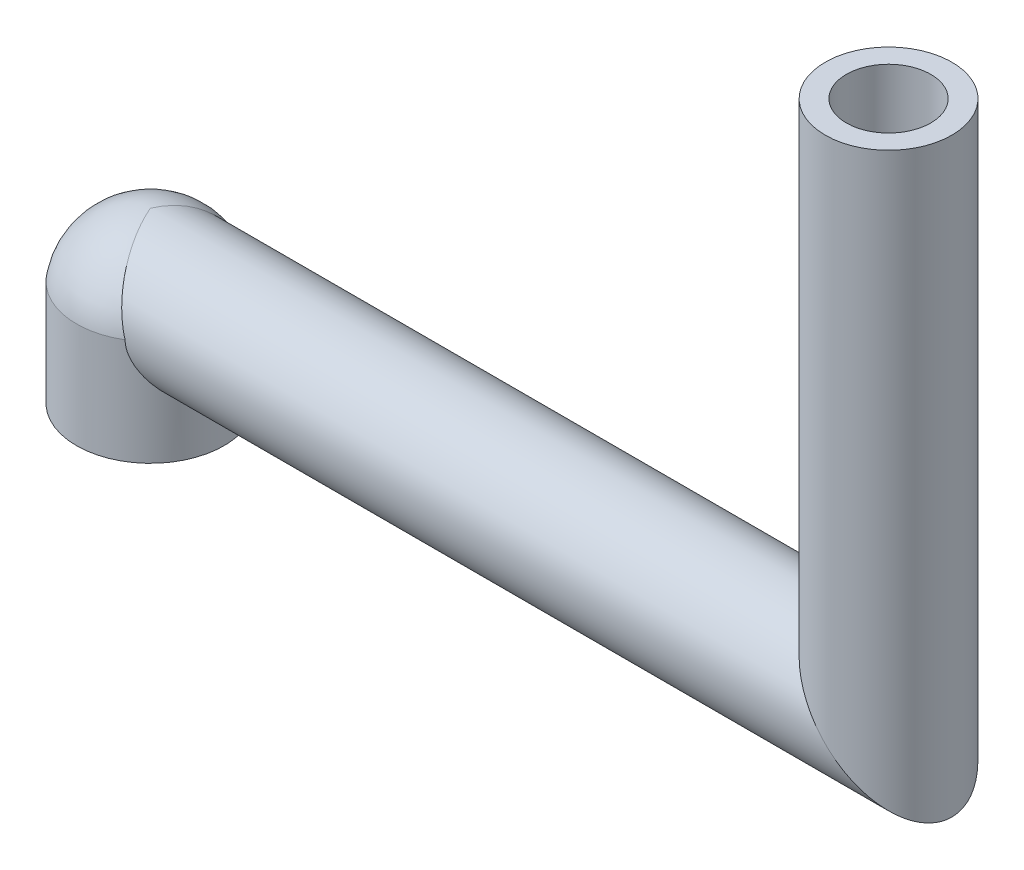
ISO-10303-21;
HEADER;
FILE_DESCRIPTION(('STEP AP214'),'2;1');
FILE_NAME('part.step','',(''),(''),'','','');
FILE_SCHEMA(('AUTOMOTIVE_DESIGN { 1 0 10303 214 1 1 1 1 }'));
ENDSEC;
DATA;
#1=APPLICATION_CONTEXT('core data for automotive mechanical design processes');
#2=APPLICATION_PROTOCOL_DEFINITION('international standard','automotive_design',2000,#1);
#3=PRODUCT_CONTEXT('',#1,'mechanical');
#4=PRODUCT('Part','Part','',(#3));
#5=PRODUCT_RELATED_PRODUCT_CATEGORY('part','',(#4));
#6=PRODUCT_DEFINITION_FORMATION('','',#4);
#7=PRODUCT_DEFINITION_CONTEXT('part definition',#1,'design');
#8=PRODUCT_DEFINITION('design','',#6,#7);
#9=PRODUCT_DEFINITION_SHAPE('','',#8);
#10=(LENGTH_UNIT() NAMED_UNIT(*) SI_UNIT(.MILLI.,.METRE.));
#11=(NAMED_UNIT(*) PLANE_ANGLE_UNIT() SI_UNIT($,.RADIAN.));
#12=(NAMED_UNIT(*) SI_UNIT($,.STERADIAN.) SOLID_ANGLE_UNIT());
#13=UNCERTAINTY_MEASURE_WITH_UNIT(LENGTH_MEASURE(1.E-05),#10,'distance_accuracy_value','');
#14=(GEOMETRIC_REPRESENTATION_CONTEXT(3) GLOBAL_UNCERTAINTY_ASSIGNED_CONTEXT((#13)) GLOBAL_UNIT_ASSIGNED_CONTEXT((#10,
#11,#12)) REPRESENTATION_CONTEXT('',''));
#15=CARTESIAN_POINT('',(0.,0.,0.));
#16=DIRECTION('',(0.,0.,1.));
#17=DIRECTION('',(1.,0.,0.));
#18=AXIS2_PLACEMENT_3D('',#15,#16,#17);
#19=CARTESIAN_POINT('',(0.,10.,0.));
#20=DIRECTION('',(0.,-1.,0.));
#21=DIRECTION('',(0.,0.,-1.));
#22=AXIS2_PLACEMENT_3D('',#19,#20,#21);
#23=CYLINDRICAL_SURFACE('',#22,7.);
#24=CARTESIAN_POINT('',(0.,0.,0.));
#25=DIRECTION('',(0.,1.,0.));
#26=DIRECTION('',(0.,0.,1.));
#27=AXIS2_PLACEMENT_3D('',#24,#25,#26);
#28=CIRCLE('',#27,7.);
#29=CARTESIAN_POINT('',(0.,0.,7.));
#30=VERTEX_POINT('',#29);
#31=EDGE_CURVE('E164',#30,#30,#28,.T.);
#32=ORIENTED_EDGE('',*,*,#31,.T.);
#33=EDGE_LOOP('',(#32));
#34=FACE_BOUND('',#33,.T.);
#35=CARTESIAN_POINT('',(3.60555127546396,10.,6.00000000000002));
#36=CARTESIAN_POINT('',(3.60547036212416,9.89804370812356,6.0000246722717));
#37=CARTESIAN_POINT('',(3.60987391766916,9.79613963751222,5.99740240844066));
#38=CARTESIAN_POINT('',(3.62701295704671,9.59350608039221,5.987065374599));
#39=CARTESIAN_POINT('',(3.63973063231986,9.4927745506641,5.979361488932));
#40=CARTESIAN_POINT('',(3.67260481569028,9.29468660937846,5.95922097253559));
#41=CARTESIAN_POINT('',(3.69264095359341,9.19730202604284,5.94686082773026));
#42=CARTESIAN_POINT('',(3.73922423302548,9.00474910130982,5.91768214083916));
#43=CARTESIAN_POINT('',(3.7657753228357,8.90958214230653,5.90086089467351));
#44=CARTESIAN_POINT('',(3.83691456380175,8.68160904095072,5.85495992001992));
#45=CARTESIAN_POINT('',(3.88435847056552,8.55012986512836,5.82371511395505));
#46=CARTESIAN_POINT('',(3.98761571608594,8.29265972277671,5.75350486483388));
#47=CARTESIAN_POINT('',(4.04343277746516,8.16667122966633,5.71453598524148));
#48=CARTESIAN_POINT('',(4.16156235964495,7.91900302304048,5.62909902100389));
#49=CARTESIAN_POINT('',(4.22392610410763,7.79736908921336,5.58256995309911));
#50=CARTESIAN_POINT('',(4.3528500422748,7.55923893407384,5.48264179156024));
#51=CARTESIAN_POINT('',(4.41941166274536,7.44274448267161,5.42924035567201));
#52=CARTESIAN_POINT('',(4.59036466873114,7.15555509356994,5.28644926991219));
#53=CARTESIAN_POINT('',(4.69649806377544,6.98802916456967,5.19274271694124));
#54=CARTESIAN_POINT('',(4.91090180299043,6.66357480578484,4.99047228829946));
#55=CARTESIAN_POINT('',(5.01917315608421,6.50665154180028,4.88190124725009));
#56=CARTESIAN_POINT('',(5.23449905058022,6.20378099067085,4.65026568331874));
#57=CARTESIAN_POINT('',(5.34155591533964,6.05780787210346,4.52723714781688));
#58=CARTESIAN_POINT('',(5.55208237498469,5.7769392100703,4.26643357637737));
#59=CARTESIAN_POINT('',(5.65555344660076,5.64203907434609,4.12866470880979));
#60=CARTESIAN_POINT('',(5.83414938779182,5.41292862244377,3.87060180367802));
#61=CARTESIAN_POINT('',(5.91046139042683,5.31634041559422,3.75323367435683));
#62=CARTESIAN_POINT('',(6.05834954202694,5.13104553705866,3.50951820505768));
#63=CARTESIAN_POINT('',(6.12992424698984,5.04234126572004,3.38316815136841));
#64=CARTESIAN_POINT('',(6.26705562036234,4.87375523221967,3.1218214865252));
#65=CARTESIAN_POINT('',(6.33261841906933,4.79386446571633,2.98683392698224));
#66=CARTESIAN_POINT('',(6.45656005271853,4.64379270781017,2.70850750625082));
#67=CARTESIAN_POINT('',(6.51494346346373,4.573605528216,2.56517405109407));
#68=CARTESIAN_POINT('',(6.61353275771719,4.45566385947278,2.29732671258316));
#69=CARTESIAN_POINT('',(6.65511683287064,4.40614769360595,2.17409372302954));
#70=CARTESIAN_POINT('',(6.73198442083407,4.31491264095875,1.9229198274818));
#71=CARTESIAN_POINT('',(6.76727098550224,4.27318997688289,1.79498123833903));
#72=CARTESIAN_POINT('',(6.83093065394354,4.19810290418303,1.53502058999276));
#73=CARTESIAN_POINT('',(6.85930547317039,4.16473642154705,1.40299955321418));
#74=CARTESIAN_POINT('',(6.9086013686167,4.10686817225511,1.13564992945659));
#75=CARTESIAN_POINT('',(6.92952236119944,4.08236650506804,1.00032130538255));
#76=CARTESIAN_POINT('',(6.96355301327933,4.04255272191827,0.726657866961199));
#77=CARTESIAN_POINT('',(6.97662420311247,4.02728586052702,0.588311636313161));
#78=CARTESIAN_POINT('',(6.9945029914123,4.00641165768735,0.31035677551487));
#79=CARTESIAN_POINT('',(6.99931057187197,4.0008043372878,0.170748142614414));
#80=CARTESIAN_POINT('',(7.00055124135237,3.99935688090529,-0.108545161616421));
#81=CARTESIAN_POINT('',(6.99698503808622,4.00351591951525,-0.248229825523487));
#82=CARTESIAN_POINT('',(6.98156237675572,4.02151903548379,-0.526503787347895));
#83=CARTESIAN_POINT('',(6.96970628522401,4.03536268464289,-0.665093133420117));
#84=CARTESIAN_POINT('',(6.93919943392786,4.07103992588827,-0.929415156963142));
#85=CARTESIAN_POINT('',(6.92114580041837,4.09217193705131,-1.05531249380987));
#86=CARTESIAN_POINT('',(6.87854412243211,4.14213887935586,-1.30446674401049));
#87=CARTESIAN_POINT('',(6.85399390891276,4.17097638319652,-1.42772276060995));
#88=CARTESIAN_POINT('',(6.77121269888179,4.26846259934172,-1.79238693986752));
#89=CARTESIAN_POINT('',(6.70382612505575,4.34811398703687,-2.02889962269133));
#90=CARTESIAN_POINT('',(6.54282979784047,4.54000464316717,-2.50171476194193));
#91=CARTESIAN_POINT('',(6.44761236627496,4.65426557589442,-2.7366262017243));
#92=CARTESIAN_POINT('',(6.2389505247778,4.90787650135905,-3.18377260614619));
#93=CARTESIAN_POINT('',(6.12549312681025,5.04724438045658,-3.39599123138593));
#94=CARTESIAN_POINT('',(5.91540596479491,5.30994699002097,-3.74684226598238));
#95=CARTESIAN_POINT('',(5.82157741972863,5.42869112040897,-3.8906746614845));
#96=CARTESIAN_POINT('',(5.62868409451349,5.67701358732874,-4.16485209069704));
#97=CARTESIAN_POINT('',(5.52961904128681,5.80659248908671,-4.29519641997004));
#98=CARTESIAN_POINT('',(5.32815307729411,6.0760670928201,-4.54272102631376));
#99=CARTESIAN_POINT('',(5.22574478436658,6.21598662822004,-4.65986921553675));
#100=CARTESIAN_POINT('',(5.02011385518584,6.50544076207825,-4.88069579749776));
#101=CARTESIAN_POINT('',(4.91689147766144,6.65497240577142,-4.98437830027052));
#102=CARTESIAN_POINT('',(4.73357160315915,6.93160218640827,-5.158077845827));
#103=CARTESIAN_POINT('',(4.65312932451712,7.0568983990718,-5.23061188036413));
#104=CARTESIAN_POINT('',(4.49502522662879,7.31382707461494,-5.36708920583135));
#105=CARTESIAN_POINT('',(4.41736386362834,7.44546056897888,-5.43103109180011));
#106=CARTESIAN_POINT('',(4.26709757550177,7.71513135037182,-5.54986730433174));
#107=CARTESIAN_POINT('',(4.19448160432289,7.85315346993735,-5.60478178002041));
#108=CARTESIAN_POINT('',(4.05691479519524,8.13616797320942,-5.70514560670919));
#109=CARTESIAN_POINT('',(3.99195879490004,8.28115556879709,-5.75060134828968));
#110=CARTESIAN_POINT('',(3.85912418276688,8.61392783624545,-5.84080866448271));
#111=CARTESIAN_POINT('',(3.79419551269841,8.80371710445974,-5.88284486943224));
#112=CARTESIAN_POINT('',(3.71610666551749,9.09545587577331,-5.93224287810196));
#113=CARTESIAN_POINT('',(3.69331447271164,9.19372323508945,-5.94642159471953));
#114=CARTESIAN_POINT('',(3.65512236777081,9.39223150110757,-5.96997366632121));
#115=CARTESIAN_POINT('',(3.6397175350949,9.49247104772689,-5.9793502201929));
#116=CARTESIAN_POINT('',(3.62086486797522,9.6606735204183,-5.99077764733245));
#117=CARTESIAN_POINT('',(3.61514488276251,9.72829533186126,-5.99422738596062));
#118=CARTESIAN_POINT('',(3.60747739393484,9.86393923210793,-5.99884258803653));
#119=CARTESIAN_POINT('',(3.60553602660715,9.93196179236485,-6.00000433593746));
#120=CARTESIAN_POINT('',(3.60555127546396,10.,-6.00000000000002));
#121=B_SPLINE_CURVE_WITH_KNOTS('',3,(#35,#36,#37,#38,#39,#40,#41,#42,#43,#44,#45,#46,#47,#48,
#49,#50,#51,#52,#53,#54,#55,#56,#57,#58,#59,#60,#61,#62,#63,#64,#65,#66,#67,#68,#69,#70,#71,#72,
#73,#74,#75,#76,#77,#78,#79,#80,#81,#82,#83,#84,#85,#86,#87,#88,#89,#90,#91,#92,#93,#94,#95,#96,
#97,#98,#99,#100,#101,#102,#103,#104,#105,#106,#107,#108,#109,#110,#111,#112,#113,#114,#115,
#116,#117,#118,#119,#120),.UNSPECIFIED.,.F.,.F.,(4,2,2,2,2,2,2,2,2,2,2,2,2,2,2,2,2,2,2,2,2,2,2,
2,2,2,2,2,2,2,2,2,2,2,2,2,2,2,2,2,2,2,4),(0.,0.305656710369213,0.610660850246282,
0.910859081826459,1.21123969498766,1.6402070099693,2.06936560796638,2.50217553922168,
2.93513337422726,3.59227610055181,4.24973672311138,4.90559415286045,5.56117819226304,
6.07098998168865,6.58095646075764,7.09039700951222,7.59951116324354,8.01660684066654,
8.43349983578319,8.850289254893,9.26708335050039,9.68590371232339,10.1047249867868,
10.5235108657049,10.9422782294168,11.3286236858903,11.7150982963756,12.4874190993496,
13.3186269655759,14.1504293486897,14.7760209169311,15.4016451412945,16.0287592173158,
16.6556814317077,17.1522234267654,17.6488465162747,18.1443456368156,18.6395088897279,
19.2519207150776,19.5571998979577,19.8622754583907,20.0659934672637,20.270042028918),.UNSPECIFIED.);
#122=CARTESIAN_POINT('',(3.60555127546397,10.,6.00000000000001));
#123=VERTEX_POINT('',#122);
#124=CARTESIAN_POINT('',(3.60555127546397,10.,-6.00000000000001));
#125=VERTEX_POINT('',#124);
#126=EDGE_CURVE('E60',#123,#125,#121,.T.);
#127=ORIENTED_EDGE('',*,*,#126,.F.);
#128=CARTESIAN_POINT('',(0.,10.,0.));
#129=DIRECTION('',(0.,1.,0.));
#130=DIRECTION('',(0.,0.,1.));
#131=AXIS2_PLACEMENT_3D('',#128,#129,#130);
#132=CIRCLE('',#131,7.);
#133=EDGE_CURVE('E163',#125,#123,#132,.T.);
#134=ORIENTED_EDGE('',*,*,#133,.F.);
#135=EDGE_LOOP('',(#127,#134));
#136=FACE_BOUND('',#135,.T.);
#137=ADVANCED_FACE('F35',(#34,#136),#23,.T.);
#138=CARTESIAN_POINT('',(0.,10.,0.));
#139=DIRECTION('',(0.,-1.,0.));
#140=DIRECTION('',(0.,0.,-1.));
#141=AXIS2_PLACEMENT_3D('',#138,#139,#140);
#142=CYLINDRICAL_SURFACE('',#141,6.);
#143=CARTESIAN_POINT('',(0.,0.,0.));
#144=DIRECTION('',(0.,1.,0.));
#145=DIRECTION('',(0.,0.,1.));
#146=AXIS2_PLACEMENT_3D('',#143,#144,#145);
#147=CIRCLE('',#146,6.);
#148=CARTESIAN_POINT('',(0.,0.,6.));
#149=VERTEX_POINT('',#148);
#150=EDGE_CURVE('E189',#149,#149,#147,.T.);
#151=ORIENTED_EDGE('',*,*,#150,.F.);
#152=EDGE_LOOP('',(#151));
#153=FACE_BOUND('',#152,.T.);
#154=CARTESIAN_POINT('',(0.,10.,0.));
#155=DIRECTION('',(0.,1.,0.));
#156=DIRECTION('',(-1.,0.,0.));
#157=AXIS2_PLACEMENT_3D('',#154,#155,#156);
#158=CIRCLE('',#157,6.);
#159=CARTESIAN_POINT('',(-6.,10.,0.));
#160=VERTEX_POINT('',#159);
#161=EDGE_CURVE('E146',#160,#160,#158,.T.);
#162=ORIENTED_EDGE('',*,*,#161,.T.);
#163=EDGE_LOOP('',(#162));
#164=FACE_BOUND('',#163,.T.);
#165=ADVANCED_FACE('F172',(#153,#164),#142,.F.);
#166=CARTESIAN_POINT('',(0.,10.,0.));
#167=DIRECTION('',(0.,1.,0.));
#168=DIRECTION('',(-1.,0.,0.));
#169=AXIS2_PLACEMENT_3D('',#166,#167,#168);
#170=PLANE('',#169);
#171=ORIENTED_EDGE('',*,*,#161,.F.);
#172=EDGE_LOOP('',(#171));
#173=FACE_BOUND('',#172,.T.);
#174=ADVANCED_FACE('F171',(#173),#170,.F.);
#175=CARTESIAN_POINT('',(0.,8.91666666666667,0.));
#176=DIRECTION('',(0.,1.,0.));
#177=DIRECTION('',(1.,0.,0.));
#178=AXIS2_PLACEMENT_3D('',#175,#176,#177);
#179=SPHERICAL_SURFACE('',#178,7.08333333333333);
#180=CARTESIAN_POINT('',(1.67067214763308E-13,16.,0.));
#181=CARTESIAN_POINT('',(0.00516384013119269,16.0000000466886,0.0121525489403494));
#182=CARTESIAN_POINT('',(0.010327849237896,15.9999631201176,0.02430549502575));
#183=CARTESIAN_POINT('',(0.0929971160193276,15.9987802621238,0.218856118283963));
#184=CARTESIAN_POINT('',(0.170532783774701,15.9893452489476,0.401287515287254));
#185=CARTESIAN_POINT('',(0.325493799938725,15.9538757437995,0.7646766166741));
#186=CARTESIAN_POINT('',(0.402919033195525,15.9278296416788,0.945633200588406));
#187=CARTESIAN_POINT('',(0.557681141545489,15.8592274350955,1.30498574317512));
#188=CARTESIAN_POINT('',(0.635017334138205,15.8166309927287,1.4833743327078));
#189=CARTESIAN_POINT('',(0.789266999859117,15.7152338078934,1.83567586582095));
#190=CARTESIAN_POINT('',(0.866180462012388,15.656432646726,2.00958869362936));
#191=CARTESIAN_POINT('',(1.01938858413805,15.5230972091878,2.35138736919437));
#192=CARTESIAN_POINT('',(1.09568365585502,15.4485744807599,2.5192775354391));
#193=CARTESIAN_POINT('',(1.24757460184854,15.2843041510275,2.84778090242069));
#194=CARTESIAN_POINT('',(1.3231704436905,15.1945558471645,3.00839376692525));
#195=CARTESIAN_POINT('',(1.4734561017415,15.0005703015236,3.32085601766248));
#196=CARTESIAN_POINT('',(1.5481466073335,14.8963449499963,3.47271245231522));
#197=CARTESIAN_POINT('',(1.6965669435357,14.6740782746742,3.76655541841428));
#198=CARTESIAN_POINT('',(1.77029643857491,14.5560322613217,3.90853857350923));
#199=CARTESIAN_POINT('',(1.9159097936079,14.3082486893345,4.18000433972032));
#200=CARTESIAN_POINT('',(1.98780463857996,14.1786363088991,4.30959530874765));
#201=CARTESIAN_POINT('',(2.13034240920554,13.9077171280386,4.55668283334401));
#202=CARTESIAN_POINT('',(2.20098533429813,13.766410322374,4.67417938349427));
#203=CARTESIAN_POINT('',(2.34087396995692,13.473169845065,4.8960076053331));
#204=CARTESIAN_POINT('',(2.41011969206645,13.3212362612629,5.00033938582316));
#205=CARTESIAN_POINT('',(2.54706755960571,13.0079086353771,5.19485187660067));
#206=CARTESIAN_POINT('',(2.6147697367782,12.8465147880864,5.28503287812145));
#207=CARTESIAN_POINT('',(2.74708431766794,12.5189905291894,5.44862295750544));
#208=CARTESIAN_POINT('',(2.81173172641159,12.3530296876726,5.52234326429514));
#209=CARTESIAN_POINT('',(2.93926255594296,12.0145237197694,5.65461863209642));
#210=CARTESIAN_POINT('',(3.00214607234309,11.8419789514685,5.7131745165229));
#211=CARTESIAN_POINT('',(3.12600802804531,11.4916504305052,5.81448418521166));
#212=CARTESIAN_POINT('',(3.18698653727079,11.3138668705994,5.8572385500948));
#213=CARTESIAN_POINT('',(3.30687348763903,10.9545443552268,5.92640734230762));
#214=CARTESIAN_POINT('',(3.36578278969929,10.7730070127307,5.95282864300437));
#215=CARTESIAN_POINT('',(3.47971765511948,10.4129452607162,5.98842531818167));
#216=CARTESIAN_POINT('',(3.53480644501942,10.2344885272415,5.99808353604903));
#217=CARTESIAN_POINT('',(3.64278900118831,9.8767707682673,6.0014006765647));
#218=CARTESIAN_POINT('',(3.69568290283288,9.69750979312955,5.9950605874468));
#219=CARTESIAN_POINT('',(3.79924877142058,9.33925925459507,5.9662180303937));
#220=CARTESIAN_POINT('',(3.84991618480503,9.16027090995807,5.94368393931394));
#221=CARTESIAN_POINT('',(3.94880074363196,8.80434777276485,5.88244065563786));
#222=CARTESIAN_POINT('',(3.99701724302672,8.6274135310455,5.84372722279962));
#223=CARTESIAN_POINT('',(4.04393598202815,8.45226851073433,5.79694119662566));
#224=B_SPLINE_CURVE_WITH_KNOTS('',3,(#180,#181,#182,#183,#184,#185,#186,#187,#188,#189,#190,
#191,#192,#193,#194,#195,#196,#197,#198,#199,#200,#201,#202,#203,#204,#205,#206,#207,#208,#209,
#210,#211,#212,#213,#214,#215,#216,#217,#218,#219,#220,#221,#222,#223),.UNSPECIFIED.,.F.,.F.,(4,
2,2,2,2,2,2,2,2,2,2,2,2,2,2,2,2,2,2,2,2,4),(0.,0.039613672377645,0.634148233788776,
1.22909879507073,1.82550861004301,2.42193383654557,3.01792248749144,3.61393864681042,
4.20946815078896,4.80520031570958,5.39512562960827,5.98505120781532,6.57497191020632,
7.16488047000675,7.74245596249554,8.32000008656074,8.89752298687515,9.47480268518373,
10.0351599913607,10.5954826844708,11.1569025419562,11.7184696273295),.UNSPECIFIED.);
#225=CARTESIAN_POINT('',(0.,16.,0.));
#226=VERTEX_POINT('',#225);
#227=EDGE_CURVE('E11',#226,#123,#224,.T.);
#228=ORIENTED_EDGE('',*,*,#227,.F.);
#229=CARTESIAN_POINT('',(1.67067214763308E-13,16.,0.));
#230=CARTESIAN_POINT('',(0.00516384013119269,16.0000000466886,-0.0121525489403494));
#231=CARTESIAN_POINT('',(0.010327849237896,15.9999631201176,-0.02430549502575));
#232=CARTESIAN_POINT('',(0.0929971160193276,15.9987802621238,-0.218856118283963));
#233=CARTESIAN_POINT('',(0.170532783774701,15.9893452489476,-0.401287515287254));
#234=CARTESIAN_POINT('',(0.325493799938725,15.9538757437995,-0.7646766166741));
#235=CARTESIAN_POINT('',(0.402919033195525,15.9278296416788,-0.945633200588406));
#236=CARTESIAN_POINT('',(0.557681141545489,15.8592274350955,-1.30498574317512));
#237=CARTESIAN_POINT('',(0.635017334138205,15.8166309927287,-1.4833743327078));
#238=CARTESIAN_POINT('',(0.789266999859117,15.7152338078934,-1.83567586582095));
#239=CARTESIAN_POINT('',(0.866180462012388,15.656432646726,-2.00958869362936));
#240=CARTESIAN_POINT('',(1.01938858413805,15.5230972091878,-2.35138736919437));
#241=CARTESIAN_POINT('',(1.09568365585502,15.4485744807599,-2.5192775354391));
#242=CARTESIAN_POINT('',(1.24757460184854,15.2843041510275,-2.84778090242069));
#243=CARTESIAN_POINT('',(1.3231704436905,15.1945558471645,-3.00839376692525));
#244=CARTESIAN_POINT('',(1.4734561017415,15.0005703015236,-3.32085601766248));
#245=CARTESIAN_POINT('',(1.5481466073335,14.8963449499963,-3.47271245231522));
#246=CARTESIAN_POINT('',(1.6965669435357,14.6740782746742,-3.76655541841428));
#247=CARTESIAN_POINT('',(1.77029643857491,14.5560322613217,-3.90853857350923));
#248=CARTESIAN_POINT('',(1.9159097936079,14.3082486893345,-4.18000433972032));
#249=CARTESIAN_POINT('',(1.98780463857996,14.1786363088991,-4.30959530874765));
#250=CARTESIAN_POINT('',(2.13034240920554,13.9077171280386,-4.55668283334401));
#251=CARTESIAN_POINT('',(2.20098533429813,13.766410322374,-4.67417938349427));
#252=CARTESIAN_POINT('',(2.34087396995692,13.473169845065,-4.8960076053331));
#253=CARTESIAN_POINT('',(2.41011969206645,13.3212362612629,-5.00033938582316));
#254=CARTESIAN_POINT('',(2.54706755960571,13.0079086353771,-5.19485187660067));
#255=CARTESIAN_POINT('',(2.6147697367782,12.8465147880864,-5.28503287812145));
#256=CARTESIAN_POINT('',(2.74708431766794,12.5189905291894,-5.44862295750544));
#257=CARTESIAN_POINT('',(2.81173172641159,12.3530296876726,-5.52234326429514));
#258=CARTESIAN_POINT('',(2.93926255594296,12.0145237197694,-5.65461863209642));
#259=CARTESIAN_POINT('',(3.00214607234309,11.8419789514685,-5.7131745165229));
#260=CARTESIAN_POINT('',(3.12600802804531,11.4916504305052,-5.81448418521166));
#261=CARTESIAN_POINT('',(3.18698653727079,11.3138668705994,-5.8572385500948));
#262=CARTESIAN_POINT('',(3.30687348763903,10.9545443552268,-5.92640734230762));
#263=CARTESIAN_POINT('',(3.36578278969929,10.7730070127307,-5.95282864300437));
#264=CARTESIAN_POINT('',(3.47971765511948,10.4129452607162,-5.98842531818167));
#265=CARTESIAN_POINT('',(3.53480644501942,10.2344885272415,-5.99808353604903));
#266=CARTESIAN_POINT('',(3.64278900118831,9.8767707682673,-6.0014006765647));
#267=CARTESIAN_POINT('',(3.69568290283288,9.69750979312955,-5.9950605874468));
#268=CARTESIAN_POINT('',(3.79924877142058,9.33925925459507,-5.9662180303937));
#269=CARTESIAN_POINT('',(3.84991618480503,9.16027090995807,-5.94368393931394));
#270=CARTESIAN_POINT('',(3.94880074363196,8.80434777276485,-5.88244065563786));
#271=CARTESIAN_POINT('',(3.99701724302672,8.6274135310455,-5.84372722279962));
#272=CARTESIAN_POINT('',(4.04393598202815,8.45226851073433,-5.79694119662566));
#273=B_SPLINE_CURVE_WITH_KNOTS('',3,(#229,#230,#231,#232,#233,#234,#235,#236,#237,#238,#239,
#240,#241,#242,#243,#244,#245,#246,#247,#248,#249,#250,#251,#252,#253,#254,#255,#256,#257,#258,
#259,#260,#261,#262,#263,#264,#265,#266,#267,#268,#269,#270,#271,#272),.UNSPECIFIED.,.F.,.F.,(4,
2,2,2,2,2,2,2,2,2,2,2,2,2,2,2,2,2,2,2,2,4),(0.,0.039613672377645,0.634148233788776,
1.22909879507073,1.82550861004301,2.42193383654557,3.01792248749144,3.61393864681042,
4.20946815078896,4.80520031570958,5.39512562960827,5.98505120781532,6.57497191020632,
7.16488047000675,7.74245596249554,8.32000008656074,8.89752298687515,9.47480268518373,
10.0351599913607,10.5954826844708,11.1569025419562,11.7184696273295),.UNSPECIFIED.);
#274=EDGE_CURVE('E48',#125,#226,#273,.F.);
#275=ORIENTED_EDGE('',*,*,#274,.F.);
#276=ORIENTED_EDGE('',*,*,#133,.T.);
#277=EDGE_LOOP('',(#228,#275,#276));
#278=FACE_BOUND('',#277,.T.);
#279=ADVANCED_FACE('F166',(#278),#179,.T.);
#280=CARTESIAN_POINT('',(0.,0.,0.));
#281=DIRECTION('',(0.,1.,0.));
#282=DIRECTION('',(0.,0.,1.));
#283=AXIS2_PLACEMENT_3D('',#280,#281,#282);
#284=PLANE('',#283);
#285=ORIENTED_EDGE('',*,*,#31,.F.);
#286=EDGE_LOOP('',(#285));
#287=FACE_BOUND('',#286,.T.);
#288=ORIENTED_EDGE('',*,*,#150,.T.);
#289=EDGE_LOOP('',(#288));
#290=FACE_BOUND('',#289,.T.);
#291=ADVANCED_FACE('F170',(#287,#290),#284,.F.);
#292=CARTESIAN_POINT('',(70.,60.,0.));
#293=DIRECTION('',(0.,-1.,0.));
#294=DIRECTION('',(0.,0.,-1.));
#295=AXIS2_PLACEMENT_3D('',#292,#293,#294);
#296=CYLINDRICAL_SURFACE('',#295,6.00000000000002);
#297=CARTESIAN_POINT('',(70.,60.,0.));
#298=DIRECTION('',(0.,1.,0.));
#299=DIRECTION('',(0.,0.,1.));
#300=AXIS2_PLACEMENT_3D('',#297,#298,#299);
#301=CIRCLE('',#300,6.00000000000002);
#302=CARTESIAN_POINT('',(70.,60.,6.00000000000002));
#303=VERTEX_POINT('',#302);
#304=EDGE_CURVE('E136',#303,#303,#301,.T.);
#305=ORIENTED_EDGE('',*,*,#304,.F.);
#306=EDGE_LOOP('',(#305));
#307=FACE_BOUND('',#306,.T.);
#308=CARTESIAN_POINT('',(70.,9.99999999999999,0.));
#309=DIRECTION('',(-0.707106781186547,-0.707106781186547,0.));
#310=DIRECTION('',(0.707106781186548,-0.707106781186548,0.));
#311=AXIS2_PLACEMENT_3D('',#308,#309,#310);
#312=ELLIPSE('',#311,8.48528137423859,6.00000000000002);
#313=CARTESIAN_POINT('',(76.,3.99999999999997,0.));
#314=VERTEX_POINT('',#313);
#315=EDGE_CURVE('E139',#314,#314,#312,.T.);
#316=ORIENTED_EDGE('',*,*,#315,.F.);
#317=EDGE_LOOP('',(#316));
#318=FACE_BOUND('',#317,.T.);
#319=ADVANCED_FACE('F155',(#307,#318),#296,.T.);
#320=CARTESIAN_POINT('',(70.,60.,0.));
#321=DIRECTION('',(0.,1.,0.));
#322=DIRECTION('',(0.,0.,1.));
#323=AXIS2_PLACEMENT_3D('',#320,#321,#322);
#324=PLANE('',#323);
#325=CARTESIAN_POINT('',(70.,60.,0.));
#326=DIRECTION('',(0.,1.,0.));
#327=DIRECTION('',(0.,0.,1.));
#328=AXIS2_PLACEMENT_3D('',#325,#326,#327);
#329=CIRCLE('',#328,4.00000000000002);
#330=CARTESIAN_POINT('',(70.,60.,4.00000000000002));
#331=VERTEX_POINT('',#330);
#332=EDGE_CURVE('E130',#331,#331,#329,.T.);
#333=ORIENTED_EDGE('',*,*,#332,.F.);
#334=EDGE_LOOP('',(#333));
#335=FACE_BOUND('',#334,.T.);
#336=ORIENTED_EDGE('',*,*,#304,.T.);
#337=EDGE_LOOP('',(#336));
#338=FACE_BOUND('',#337,.T.);
#339=ADVANCED_FACE('F153',(#335,#338),#324,.T.);
#340=CARTESIAN_POINT('',(83.3,9.99999999999998,0.));
#341=DIRECTION('',(-1.,0.,0.));
#342=DIRECTION('',(0.,-1.,0.));
#343=AXIS2_PLACEMENT_3D('',#340,#341,#342);
#344=CYLINDRICAL_SURFACE('',#343,6.00000000000002);
#345=ORIENTED_EDGE('',*,*,#315,.T.);
#346=EDGE_LOOP('',(#345));
#347=FACE_BOUND('',#346,.T.);
#348=ORIENTED_EDGE('',*,*,#227,.T.);
#349=ORIENTED_EDGE('',*,*,#126,.T.);
#350=ORIENTED_EDGE('',*,*,#274,.T.);
#351=EDGE_LOOP('',(#348,#349,#350));
#352=FACE_BOUND('',#351,.T.);
#353=ADVANCED_FACE('F148',(#347,#352),#344,.T.);
#354=CARTESIAN_POINT('',(0.,12.,0.));
#355=DIRECTION('',(0.,1.,0.));
#356=DIRECTION('',(-1.,0.,0.));
#357=AXIS2_PLACEMENT_3D('',#354,#355,#356);
#358=PLANE('',#357);
#359=CARTESIAN_POINT('',(0.,12.,0.));
#360=DIRECTION('',(0.,1.,0.));
#361=DIRECTION('',(-1.,0.,0.));
#362=AXIS2_PLACEMENT_3D('',#359,#360,#361);
#363=CIRCLE('',#362,4.04145188432738);
#364=CARTESIAN_POINT('',(2.08166599946612,12.,-3.46410161513776));
#365=VERTEX_POINT('',#364);
#366=CARTESIAN_POINT('',(2.08166599946612,12.,3.46410161513776));
#367=VERTEX_POINT('',#366);
#368=EDGE_CURVE('E90',#365,#367,#363,.T.);
#369=ORIENTED_EDGE('',*,*,#368,.T.);
#370=DIRECTION('',(-1.,0.,0.));
#371=VECTOR('',#370,1.);
#372=CARTESIAN_POINT('',(83.3,12.,3.46410161513776));
#373=LINE('',#372,#371);
#374=CARTESIAN_POINT('',(7.21110255092797,12.,3.46410161513776));
#375=VERTEX_POINT('',#374);
#376=EDGE_CURVE('E99',#367,#375,#373,.F.);
#377=ORIENTED_EDGE('',*,*,#376,.T.);
#378=CARTESIAN_POINT('',(0.,12.,0.));
#379=DIRECTION('',(0.,1.,0.));
#380=DIRECTION('',(-1.,0.,0.));
#381=AXIS2_PLACEMENT_3D('',#378,#379,#380);
#382=CIRCLE('',#381,8.);
#383=CARTESIAN_POINT('',(7.21110255092797,12.,-3.46410161513776));
#384=VERTEX_POINT('',#383);
#385=EDGE_CURVE('E94',#375,#384,#382,.T.);
#386=ORIENTED_EDGE('',*,*,#385,.T.);
#387=DIRECTION('',(-1.,0.,0.));
#388=VECTOR('',#387,1.);
#389=CARTESIAN_POINT('',(83.3,12.,-3.46410161513776));
#390=LINE('',#389,#388);
#391=EDGE_CURVE('E133',#384,#365,#390,.T.);
#392=ORIENTED_EDGE('',*,*,#391,.T.);
#393=EDGE_LOOP('',(#369,#377,#386,#392));
#394=FACE_BOUND('',#393,.T.);
#395=ADVANCED_FACE('F116',(#394),#358,.T.);
#396=CARTESIAN_POINT('',(0.,8.91666666666667,0.));
#397=DIRECTION('',(0.,1.,0.));
#398=DIRECTION('',(1.,0.,0.));
#399=AXIS2_PLACEMENT_3D('',#396,#397,#398);
#400=SPHERICAL_SURFACE('',#399,5.08333333333333);
#401=CARTESIAN_POINT('',(3.00462606288663,9.83333333333333,-3.99652626942728));
#402=CARTESIAN_POINT('',(2.96077965367362,9.95494773106552,-4.00161233709888));
#403=CARTESIAN_POINT('',(2.91601067150827,10.0764466900812,-4.00110500796589));
#404=CARTESIAN_POINT('',(2.8247596826382,10.3182200216519,-3.98915394943701));
#405=CARTESIAN_POINT('',(2.77827817331332,10.4384947370197,-3.97771337175047));
#406=CARTESIAN_POINT('',(2.68381784440679,10.6766222862016,-3.94418754020444));
#407=CARTESIAN_POINT('',(2.63584272346128,10.7944800638431,-3.92212688547366));
#408=CARTESIAN_POINT('',(2.53840603630738,11.0271698838421,-3.86771210310114));
#409=CARTESIAN_POINT('',(2.48894439455103,11.1420017718593,-3.83535745149417));
#410=CARTESIAN_POINT('',(2.38869189045718,11.3676899834173,-3.7607894205656));
#411=CARTESIAN_POINT('',(2.33790217896803,11.4785495638076,-3.71858434121386));
#412=CARTESIAN_POINT('',(2.23504486416636,11.6956401303399,-3.62474731324928));
#413=CARTESIAN_POINT('',(2.18297680681686,11.8018694336271,-3.57311197205588));
#414=CARTESIAN_POINT('',(2.07769289281793,12.0089060380622,-3.46094733281945));
#415=CARTESIAN_POINT('',(2.02447715610831,12.1097139019752,-3.4004189603489));
#416=CARTESIAN_POINT('',(1.91697847066881,12.3052693771253,-3.27100687281774));
#417=CARTESIAN_POINT('',(1.86269514898919,12.4000148195267,-3.20212019281087));
#418=CARTESIAN_POINT('',(1.75118200380497,12.5861150028399,-3.05395904959692));
#419=CARTESIAN_POINT('',(1.6939169241814,12.6772200404189,-2.97439735323451));
#420=CARTESIAN_POINT('',(1.57847787206434,12.851572028305,-2.80768343666263));
#421=CARTESIAN_POINT('',(1.52030386637943,12.9348186908612,-2.72053093872444));
#422=CARTESIAN_POINT('',(1.40311789998267,13.092936350799,-2.53933304844476));
#423=CARTESIAN_POINT('',(1.34410541991988,13.1678018770758,-2.44528321913606));
#424=CARTESIAN_POINT('',(1.22540394830345,13.3085723399076,-2.25115979686192));
#425=CARTESIAN_POINT('',(1.16571516765101,13.3744799909102,-2.15108804200276));
#426=CARTESIAN_POINT('',(1.04355231075443,13.4991681619306,-1.94195240426465));
#427=CARTESIAN_POINT('',(0.981056151545934,13.5576002814979,-1.83269356521783));
#428=CARTESIAN_POINT('',(0.855561825864602,13.6639768889986,-1.60951839397293));
#429=CARTESIAN_POINT('',(0.792563829562078,13.711924787266,-1.4956035906323));
#430=CARTESIAN_POINT('',(0.666218985757312,13.796987375934,-1.26414968433582));
#431=CARTESIAN_POINT('',(0.602872543257314,13.834112696463,-1.1466142639666));
#432=CARTESIAN_POINT('',(0.475900712275727,13.8973292107069,-0.908819033578387));
#433=CARTESIAN_POINT('',(0.412275448639872,13.9234249164975,-0.788560358861938));
#434=CARTESIAN_POINT('',(0.292644421379709,13.9619170445643,-0.561108933204283));
#435=CARTESIAN_POINT('',(0.236659760619718,13.975599768988,-0.454119651876728));
#436=CARTESIAN_POINT('',(0.124661122576735,13.9942726677712,-0.239518125324451));
#437=CARTESIAN_POINT('',(0.0686472391202052,13.9992720318759,-0.131906659773525));
#438=CARTESIAN_POINT('',(0.00843267304116044,13.9999754066467,-0.01620370039132));
#439=CARTESIAN_POINT('',(0.0042162789134476,14.0000000240745,-0.00810173965406649));
#440=CARTESIAN_POINT('',(0.,14.,0.));
#441=B_SPLINE_CURVE_WITH_KNOTS('',3,(#401,#402,#403,#404,#405,#406,#407,#408,#409,#410,#411,
#412,#413,#414,#415,#416,#417,#418,#419,#420,#421,#422,#423,#424,#425,#426,#427,#428,#429,#430,
#431,#432,#433,#434,#435,#436,#437,#438,#439,#440),.UNSPECIFIED.,.F.,.F.,(4,2,2,2,2,2,2,2,2,2,2,
2,2,2,2,2,2,2,2,4),(0.,0.387985867676989,0.775859925040074,1.16283984691065,1.54983946924127,
1.93651417549782,2.32332826478357,2.71010212355831,3.09701358613597,3.49803673288079,
3.8990745582434,4.30037266824438,4.70154890303995,5.11738334693368,5.533082325259,
5.9483716101939,6.36349084072708,6.72777281631999,7.09166903077154,7.11906929872762),.UNSPECIFIED.);
#442=CARTESIAN_POINT('',(0.,14.,0.));
#443=VERTEX_POINT('',#442);
#444=EDGE_CURVE('E86',#365,#443,#441,.T.);
#445=ORIENTED_EDGE('',*,*,#444,.T.);
#446=CARTESIAN_POINT('',(3.00462606288663,9.83333333333333,3.99652626942728));
#447=CARTESIAN_POINT('',(2.96077965367362,9.95494773106552,4.00161233709888));
#448=CARTESIAN_POINT('',(2.91601067150827,10.0764466900812,4.00110500796589));
#449=CARTESIAN_POINT('',(2.8247596826382,10.3182200216519,3.98915394943701));
#450=CARTESIAN_POINT('',(2.77827817331332,10.4384947370197,3.97771337175047));
#451=CARTESIAN_POINT('',(2.68381784440679,10.6766222862016,3.94418754020444));
#452=CARTESIAN_POINT('',(2.63584272346128,10.7944800638431,3.92212688547366));
#453=CARTESIAN_POINT('',(2.53840603630738,11.0271698838421,3.86771210310114));
#454=CARTESIAN_POINT('',(2.48894439455103,11.1420017718593,3.83535745149417));
#455=CARTESIAN_POINT('',(2.38869189045718,11.3676899834173,3.7607894205656));
#456=CARTESIAN_POINT('',(2.33790217896803,11.4785495638076,3.71858434121386));
#457=CARTESIAN_POINT('',(2.23504486416636,11.6956401303399,3.62474731324928));
#458=CARTESIAN_POINT('',(2.18297680681686,11.8018694336271,3.57311197205588));
#459=CARTESIAN_POINT('',(2.07769289281793,12.0089060380622,3.46094733281945));
#460=CARTESIAN_POINT('',(2.02447715610831,12.1097139019752,3.4004189603489));
#461=CARTESIAN_POINT('',(1.91697847066881,12.3052693771253,3.27100687281774));
#462=CARTESIAN_POINT('',(1.86269514898919,12.4000148195267,3.20212019281087));
#463=CARTESIAN_POINT('',(1.75118200380497,12.5861150028399,3.05395904959692));
#464=CARTESIAN_POINT('',(1.6939169241814,12.6772200404189,2.97439735323451));
#465=CARTESIAN_POINT('',(1.57847787206434,12.851572028305,2.80768343666263));
#466=CARTESIAN_POINT('',(1.52030386637943,12.9348186908612,2.72053093872444));
#467=CARTESIAN_POINT('',(1.40311789998267,13.092936350799,2.53933304844476));
#468=CARTESIAN_POINT('',(1.34410541991988,13.1678018770758,2.44528321913606));
#469=CARTESIAN_POINT('',(1.22540394830345,13.3085723399076,2.25115979686192));
#470=CARTESIAN_POINT('',(1.16571516765101,13.3744799909102,2.15108804200276));
#471=CARTESIAN_POINT('',(1.04355231075443,13.4991681619306,1.94195240426465));
#472=CARTESIAN_POINT('',(0.981056151545934,13.5576002814979,1.83269356521783));
#473=CARTESIAN_POINT('',(0.855561825864602,13.6639768889986,1.60951839397293));
#474=CARTESIAN_POINT('',(0.792563829562078,13.711924787266,1.4956035906323));
#475=CARTESIAN_POINT('',(0.666218985757312,13.796987375934,1.26414968433582));
#476=CARTESIAN_POINT('',(0.602872543257314,13.834112696463,1.1466142639666));
#477=CARTESIAN_POINT('',(0.475900712275727,13.8973292107069,0.908819033578387));
#478=CARTESIAN_POINT('',(0.412275448639872,13.9234249164975,0.788560358861938));
#479=CARTESIAN_POINT('',(0.292644421379709,13.9619170445643,0.561108933204283));
#480=CARTESIAN_POINT('',(0.236659760619718,13.975599768988,0.454119651876728));
#481=CARTESIAN_POINT('',(0.124661122576735,13.9942726677712,0.239518125324451));
#482=CARTESIAN_POINT('',(0.0686472391202052,13.9992720318759,0.131906659773525));
#483=CARTESIAN_POINT('',(0.00843267304116044,13.9999754066467,0.01620370039132));
#484=CARTESIAN_POINT('',(0.0042162789134476,14.0000000240745,0.00810173965406649));
#485=CARTESIAN_POINT('',(0.,14.,0.));
#486=B_SPLINE_CURVE_WITH_KNOTS('',3,(#446,#447,#448,#449,#450,#451,#452,#453,#454,#455,#456,
#457,#458,#459,#460,#461,#462,#463,#464,#465,#466,#467,#468,#469,#470,#471,#472,#473,#474,#475,
#476,#477,#478,#479,#480,#481,#482,#483,#484,#485),.UNSPECIFIED.,.F.,.F.,(4,2,2,2,2,2,2,2,2,2,2,
2,2,2,2,2,2,2,2,4),(0.,0.387985867676989,0.775859925040074,1.16283984691065,1.54983946924127,
1.93651417549782,2.32332826478357,2.71010212355831,3.09701358613597,3.49803673288079,
3.8990745582434,4.30037266824438,4.70154890303995,5.11738334693368,5.533082325259,
5.9483716101939,6.36349084072708,6.72777281631999,7.09166903077154,7.11906929872762),.UNSPECIFIED.);
#487=EDGE_CURVE('E89',#443,#367,#486,.F.);
#488=ORIENTED_EDGE('',*,*,#487,.T.);
#489=ORIENTED_EDGE('',*,*,#368,.F.);
#490=EDGE_LOOP('',(#445,#488,#489));
#491=FACE_BOUND('',#490,.T.);
#492=ADVANCED_FACE('F88',(#491),#400,.F.);
#493=CARTESIAN_POINT('',(83.3,9.99999999999998,0.));
#494=DIRECTION('',(-1.,0.,0.));
#495=DIRECTION('',(0.,-1.,0.));
#496=AXIS2_PLACEMENT_3D('',#493,#494,#495);
#497=CYLINDRICAL_SURFACE('',#496,4.00000000000002);
#498=CARTESIAN_POINT('',(70.,9.99999999999997,0.));
#499=DIRECTION('',(-0.707106781186547,-0.707106781186548,0.));
#500=DIRECTION('',(0.707106781186547,-0.707106781186548,0.));
#501=AXIS2_PLACEMENT_3D('',#498,#499,#500);
#502=ELLIPSE('',#501,5.6568542494924,4.00000000000002);
#503=CARTESIAN_POINT('',(74.,5.99999999999996,0.));
#504=VERTEX_POINT('',#503);
#505=EDGE_CURVE('E296',#504,#504,#502,.T.);
#506=ORIENTED_EDGE('',*,*,#505,.F.);
#507=EDGE_LOOP('',(#506));
#508=FACE_BOUND('',#507,.T.);
#509=CARTESIAN_POINT('',(7.21110255092797,12.,-3.46410161513776));
#510=CARTESIAN_POINT('',(7.18671758857971,11.9120994766985,-3.51485650693898));
#511=CARTESIAN_POINT('',(7.1632328658938,11.8220563316078,-3.56237617995007));
#512=CARTESIAN_POINT('',(7.1186603935753,11.6380701153325,-3.65063463140589));
#513=CARTESIAN_POINT('',(7.09757407069577,11.5441247677079,-3.6913693802761));
#514=CARTESIAN_POINT('',(7.05837590586152,11.3525836755671,-3.76578022691252));
#515=CARTESIAN_POINT('',(7.04027168800065,11.2549793343181,-3.79943829117518));
#516=CARTESIAN_POINT('',(7.00767581328356,11.0569092866556,-3.85922810740772));
#517=CARTESIAN_POINT('',(6.99318373493507,10.956443915615,-3.8853607375586));
#518=CARTESIAN_POINT('',(6.9682519553132,10.7528502945288,-3.92990083798861));
#519=CARTESIAN_POINT('',(6.95783009004741,10.6497123903227,-3.94827433505269));
#520=CARTESIAN_POINT('',(6.94151698958697,10.4420060896012,-3.97688501754981));
#521=CARTESIAN_POINT('',(6.93562355441641,10.3374384128527,-3.98712615388063));
#522=CARTESIAN_POINT('',(6.92859258921265,10.1278457111686,-3.99933180447868));
#523=CARTESIAN_POINT('',(6.92744665700539,10.0228218238089,-4.00131094095606));
#524=CARTESIAN_POINT('',(6.92993236745227,9.81300319918629,-3.99700429269758));
#525=CARTESIAN_POINT('',(6.93356389708018,9.70820845656094,-3.99071870349039));
#526=CARTESIAN_POINT('',(6.94508835040434,9.50627808504804,-3.97062618906116));
#527=CARTESIAN_POINT('',(6.95269807599183,9.40907623496839,-3.95731861350873));
#528=CARTESIAN_POINT('',(6.97172991881861,9.21626199060507,-3.92369052335423));
#529=CARTESIAN_POINT('',(6.98315331644422,9.12065014147474,-3.90336765338853));
#530=CARTESIAN_POINT('',(7.02264939855493,8.83700923195322,-3.8321531587154));
#531=CARTESIAN_POINT('',(7.0559481532851,8.65217192350745,-3.77101535491402));
#532=CARTESIAN_POINT('',(7.13440711360095,8.28739450943018,-3.62045441263584));
#533=CARTESIAN_POINT('',(7.18002330764099,8.10802429921253,-3.52990879773139));
#534=CARTESIAN_POINT('',(7.27762005982717,7.76602711295935,-3.32403519474082));
#535=CARTESIAN_POINT('',(7.32960258138562,7.60340533084647,-3.20869955294475));
#536=CARTESIAN_POINT('',(7.44198467579465,7.27798856095784,-2.93951226787129));
#537=CARTESIAN_POINT('',(7.50261729359896,7.11777289284902,-2.78263422735656));
#538=CARTESIAN_POINT('',(7.6198797038613,6.82500699978064,-2.44327091023523));
#539=CARTESIAN_POINT('',(7.67650781418603,6.69246835571114,-2.26077496753212));
#540=CARTESIAN_POINT('',(7.75486542084142,6.51563219620527,-1.9679341725193));
#541=CARTESIAN_POINT('',(7.78021787581726,6.45967896699479,-1.86543205608368));
#542=CARTESIAN_POINT('',(7.82761087111646,6.35670647018253,-1.65531812385751));
#543=CARTESIAN_POINT('',(7.84965286437409,6.3096832808495,-1.54770857712763));
#544=CARTESIAN_POINT('',(7.88976576124806,6.22511085120122,-1.32817413180927));
#545=CARTESIAN_POINT('',(7.90783854740483,6.18755711839536,-1.21625130868587));
#546=CARTESIAN_POINT('',(7.93946951134646,6.12237313495,-0.988930609681561));
#547=CARTESIAN_POINT('',(7.95302822326603,6.09474171020786,-0.873533146705998));
#548=CARTESIAN_POINT('',(7.97419643727711,6.05182026015916,-0.650811085008326));
#549=CARTESIAN_POINT('',(7.9822323238925,6.03564168295974,-0.543697483506642));
#550=CARTESIAN_POINT('',(7.99398928416127,6.01202175037984,-0.328279082109124));
#551=CARTESIAN_POINT('',(7.99771070145503,6.00457969914885,-0.219974377776409));
#552=CARTESIAN_POINT('',(8.00073428338241,5.99853078475834,-0.00309078855201652));
#553=CARTESIAN_POINT('',(8.0000378162985,5.99992118606114,0.105488001038238));
#554=CARTESIAN_POINT('',(7.99424894808719,6.01151141412202,0.322052521661538));
#555=CARTESIAN_POINT('',(7.98915668247105,6.02171096931633,0.430038270873236));
#556=CARTESIAN_POINT('',(7.97521340129629,6.04978898934247,0.637174302610717));
#557=CARTESIAN_POINT('',(7.96664458778779,6.06709189244177,0.736422000478745));
#558=CARTESIAN_POINT('',(7.94602443343616,6.10903212603106,0.932998448652002));
#559=CARTESIAN_POINT('',(7.93397190439536,6.13367195902875,1.03032653211135));
#560=CARTESIAN_POINT('',(7.89298598752067,6.21823969885666,1.31843195729611));
#561=CARTESIAN_POINT('',(7.85921149393243,6.28884058658303,1.50550968334284));
#562=CARTESIAN_POINT('',(7.78013738892091,6.45931545451782,1.87248210247047));
#563=CARTESIAN_POINT('',(7.73443101097604,6.56024686416431,2.05179064929843));
#564=CARTESIAN_POINT('',(7.6361774583816,6.78726452579128,2.39167593675763));
#565=CARTESIAN_POINT('',(7.58362695375482,6.91336303871147,2.55224348646348));
#566=CARTESIAN_POINT('',(7.47071283087801,7.20162971860328,2.8668991142902));
#567=CARTESIAN_POINT('',(7.41009224986431,7.36613915035988,3.01875022872669));
#568=CARTESIAN_POINT('',(7.29210537876608,7.71912637048614,3.29356986216394));
#569=CARTESIAN_POINT('',(7.23474102246092,7.90761819034618,3.41652135183944));
#570=CARTESIAN_POINT('',(7.15533145701532,8.2087412837468,3.57841098573861));
#571=CARTESIAN_POINT('',(7.129590781744,8.3141395662881,3.62927682810435));
#572=CARTESIAN_POINT('',(7.0817261054221,8.52967164321056,3.72180964508231));
#573=CARTESIAN_POINT('',(7.05960038273845,8.63980315162607,3.76348100193217));
#574=CARTESIAN_POINT('',(7.0198634616723,8.86393921728694,3.83709120330007));
#575=CARTESIAN_POINT('',(7.00224770822438,8.97793973394395,3.86903987392785));
#576=CARTESIAN_POINT('',(6.97227375447825,9.20898274151843,3.92279879821326));
#577=CARTESIAN_POINT('',(6.95991469022894,9.32602472920407,3.94461071792798));
#578=CARTESIAN_POINT('',(6.94204958764752,9.54935567090614,3.97595706526223));
#579=CARTESIAN_POINT('',(6.93594976782792,9.6554483335883,3.98655908863575));
#580=CARTESIAN_POINT('',(6.92863861620731,9.86830483394729,3.9992526393503));
#581=CARTESIAN_POINT('',(6.92742684740413,9.9750686107703,4.00134492747991));
#582=CARTESIAN_POINT('',(6.92994368414526,10.1883879479069,3.9969850202208));
#583=CARTESIAN_POINT('',(6.93367326460872,10.2949434629763,3.99053113868861));
#584=CARTESIAN_POINT('',(6.94591423504192,10.506897639496,3.9691831052565));
#585=CARTESIAN_POINT('',(6.95442544248429,10.6122963449481,3.95428927553159));
#586=CARTESIAN_POINT('',(6.98493336016506,10.9086082364055,3.90030677460789));
#587=CARTESIAN_POINT('',(7.01225491002472,11.0972773259156,3.8514010201986));
#588=CARTESIAN_POINT('',(7.07875916618218,11.4633236567149,3.72773630004308));
#589=CARTESIAN_POINT('',(7.11792729672479,11.6407144517902,3.65300908840704));
#590=CARTESIAN_POINT('',(7.17717647281949,11.8750287582376,3.53404069523825));
#591=CARTESIAN_POINT('',(7.19391899517227,11.9380598104283,3.49986843997111));
#592=CARTESIAN_POINT('',(7.21110255092799,12.,3.46410161513778));
#593=B_SPLINE_CURVE_WITH_KNOTS('',3,(#509,#510,#511,#512,#513,#514,#515,#516,#517,#518,#519,
#520,#521,#522,#523,#524,#525,#526,#527,#528,#529,#530,#531,#532,#533,#534,#535,#536,#537,#538,
#539,#540,#541,#542,#543,#544,#545,#546,#547,#548,#549,#550,#551,#552,#553,#554,#555,#556,#557,
#558,#559,#560,#561,#562,#563,#564,#565,#566,#567,#568,#569,#570,#571,#572,#573,#574,#575,#576,
#577,#578,#579,#580,#581,#582,#583,#584,#585,#586,#587,#588,#589,#590,#591,#592),.UNSPECIFIED.,
.F.,.F.,(4,2,2,2,2,2,2,2,2,2,2,2,2,2,2,2,2,2,2,2,2,2,2,2,2,2,2,2,2,2,2,2,2,2,2,2,2,2,2,2,2,4),
(0.,0.313124931646961,0.626435170556221,0.940534391441147,1.25459694363142,1.5700207025013,
1.88529112695735,2.20000334395535,2.51470811555758,2.80956536436896,3.10452170704303,
3.69442577711008,4.3101899778707,4.92614456437394,5.62000110378497,6.31414739421793,
6.67223992525401,7.03017483025563,7.38793960326759,7.74566202815983,8.07110971856851,
8.39653148582271,8.72185247018699,9.0471634260927,9.35012975036516,9.65319953013392,
10.2588015197308,10.8886139310304,11.5187339273871,12.2115934367613,12.9048602010815,
13.2639291561222,13.6228266017403,13.9813601183337,14.3398346861817,14.6597812993932,
14.9796993080624,15.2996804453683,15.6196493689761,16.2073641734899,16.7943587889361,
17.015113407278),.UNSPECIFIED.);
#594=EDGE_CURVE('E100',#384,#375,#593,.T.);
#595=ORIENTED_EDGE('',*,*,#594,.T.);
#596=ORIENTED_EDGE('',*,*,#376,.F.);
#597=ORIENTED_EDGE('',*,*,#487,.F.);
#598=ORIENTED_EDGE('',*,*,#444,.F.);
#599=ORIENTED_EDGE('',*,*,#391,.F.);
#600=EDGE_LOOP('',(#595,#596,#597,#598,#599));
#601=FACE_BOUND('',#600,.T.);
#602=ADVANCED_FACE('F98',(#508,#601),#497,.F.);
#603=CARTESIAN_POINT('',(0.,10.,0.));
#604=DIRECTION('',(0.,-1.,0.));
#605=DIRECTION('',(0.,0.,-1.));
#606=AXIS2_PLACEMENT_3D('',#603,#604,#605);
#607=CYLINDRICAL_SURFACE('',#606,8.);
#608=ORIENTED_EDGE('',*,*,#385,.F.);
#609=ORIENTED_EDGE('',*,*,#594,.F.);
#610=EDGE_LOOP('',(#608,#609));
#611=FACE_BOUND('',#610,.T.);
#612=ADVANCED_FACE('F117',(#611),#607,.T.);
#613=CARTESIAN_POINT('',(70.,60.,0.));
#614=DIRECTION('',(0.,-1.,0.));
#615=DIRECTION('',(0.,0.,-1.));
#616=AXIS2_PLACEMENT_3D('',#613,#614,#615);
#617=CYLINDRICAL_SURFACE('',#616,4.00000000000002);
#618=ORIENTED_EDGE('',*,*,#332,.T.);
#619=EDGE_LOOP('',(#618));
#620=FACE_BOUND('',#619,.T.);
#621=ORIENTED_EDGE('',*,*,#505,.T.);
#622=EDGE_LOOP('',(#621));
#623=FACE_BOUND('',#622,.T.);
#624=ADVANCED_FACE('F122',(#620,#623),#617,.F.);
#625=CLOSED_SHELL('',(#137,#165,#174,#279,#291,#319,#339,#353,#395,#492,#602,#612,#624));
#626=MANIFOLD_SOLID_BREP('B2',#625);
#627=ADVANCED_BREP_SHAPE_REPRESENTATION('',(#18,#626),#14);
#628=SHAPE_DEFINITION_REPRESENTATION(#9,#627);
ENDSEC;
END-ISO-10303-21;
